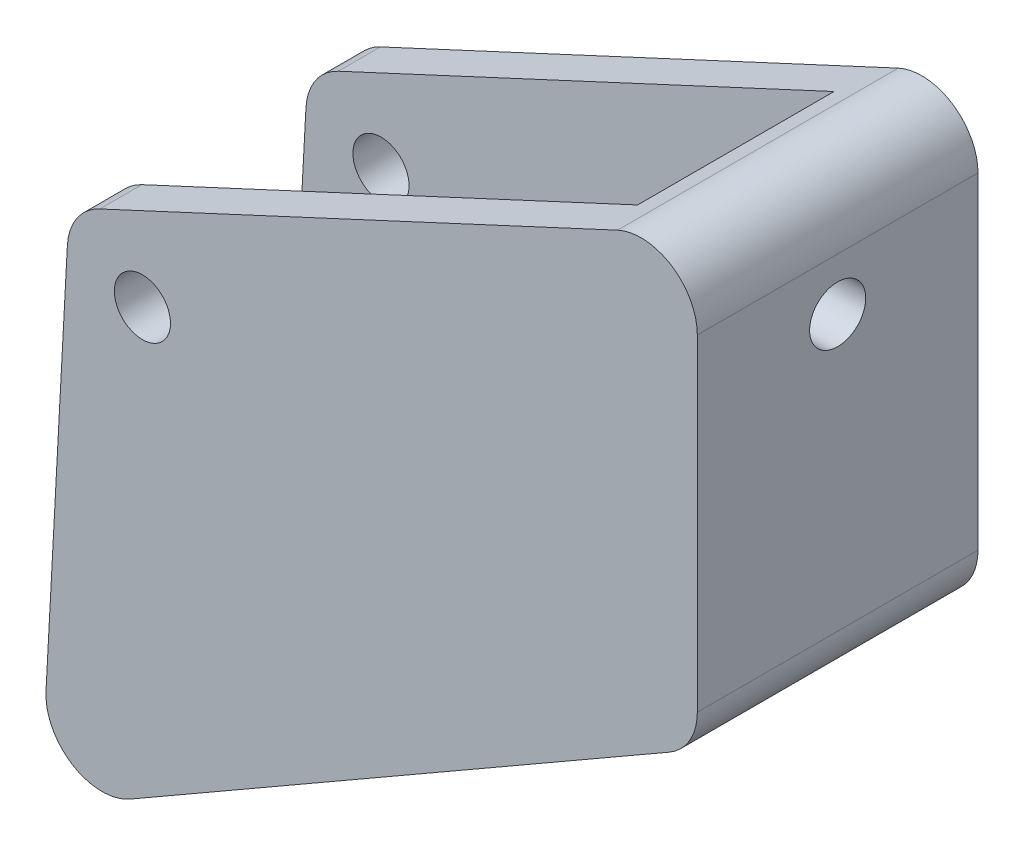
ISO-10303-21;
HEADER;
FILE_DESCRIPTION(('STEP AP214'),'2;1');
FILE_NAME('part.step','',(''),(''),'','','');
FILE_SCHEMA(('AUTOMOTIVE_DESIGN { 1 0 10303 214 1 1 1 1 }'));
ENDSEC;
DATA;
#1=APPLICATION_CONTEXT('core data for automotive mechanical design processes');
#2=APPLICATION_PROTOCOL_DEFINITION('international standard','automotive_design',2000,#1);
#3=PRODUCT_CONTEXT('',#1,'mechanical');
#4=PRODUCT('Part','Part','',(#3));
#5=PRODUCT_RELATED_PRODUCT_CATEGORY('part','',(#4));
#6=PRODUCT_DEFINITION_FORMATION('','',#4);
#7=PRODUCT_DEFINITION_CONTEXT('part definition',#1,'design');
#8=PRODUCT_DEFINITION('design','',#6,#7);
#9=PRODUCT_DEFINITION_SHAPE('','',#8);
#10=(LENGTH_UNIT() NAMED_UNIT(*) SI_UNIT(.MILLI.,.METRE.));
#11=(NAMED_UNIT(*) PLANE_ANGLE_UNIT() SI_UNIT($,.RADIAN.));
#12=(NAMED_UNIT(*) SI_UNIT($,.STERADIAN.) SOLID_ANGLE_UNIT());
#13=UNCERTAINTY_MEASURE_WITH_UNIT(LENGTH_MEASURE(1.E-05),#10,'distance_accuracy_value','');
#14=(GEOMETRIC_REPRESENTATION_CONTEXT(3) GLOBAL_UNCERTAINTY_ASSIGNED_CONTEXT((#13)) GLOBAL_UNIT_ASSIGNED_CONTEXT((#10,
#11,#12)) REPRESENTATION_CONTEXT('',''));
#15=CARTESIAN_POINT('',(0.,0.,0.));
#16=DIRECTION('',(0.,0.,1.));
#17=DIRECTION('',(1.,0.,0.));
#18=AXIS2_PLACEMENT_3D('',#15,#16,#17);
#19=CARTESIAN_POINT('',(-5.68733064188446,12.2435399362228,25.));
#20=DIRECTION('',(-0.421283751250701,0.90692888416465,0.));
#21=DIRECTION('',(-0.90692888416465,-0.421283751250701,0.));
#22=AXIS2_PLACEMENT_3D('',#19,#20,#21);
#23=PLANE('',#22);
#24=DIRECTION('',(0.90692888416465,0.421283751250701,0.));
#25=VECTOR('',#24,1.);
#26=CARTESIAN_POINT('',(-5.68733064188446,12.2435399362228,25.));
#27=LINE('',#26,#25);
#28=CARTESIAN_POINT('',(-7.59461311952046,11.3575750817532,25.));
#29=VERTEX_POINT('',#28);
#30=CARTESIAN_POINT('',(84.6368606244456,54.2006490213681,25.));
#31=VERTEX_POINT('',#30);
#32=EDGE_CURVE('E177',#29,#31,#27,.T.);
#33=ORIENTED_EDGE('',*,*,#32,.T.);
#34=DIRECTION('',(0.,0.,-1.));
#35=VECTOR('',#34,1.);
#36=CARTESIAN_POINT('',(84.6368606244456,54.2006490213681,-25.));
#37=LINE('',#36,#35);
#38=CARTESIAN_POINT('',(84.6368606244456,54.2006490213681,-25.));
#39=VERTEX_POINT('',#38);
#40=EDGE_CURVE('E220',#31,#39,#37,.T.);
#41=ORIENTED_EDGE('',*,*,#40,.T.);
#42=DIRECTION('',(0.90692888416465,0.421283751250701,0.));
#43=VECTOR('',#42,1.);
#44=CARTESIAN_POINT('',(-5.68733064188446,12.2435399362228,-25.));
#45=LINE('',#44,#43);
#46=CARTESIAN_POINT('',(-7.59461311952046,11.3575750817532,-25.));
#47=VERTEX_POINT('',#46);
#48=EDGE_CURVE('E188',#47,#39,#45,.T.);
#49=ORIENTED_EDGE('',*,*,#48,.F.);
#50=DIRECTION('',(0.,0.,-1.));
#51=VECTOR('',#50,1.);
#52=CARTESIAN_POINT('',(-7.59461311952046,11.3575750817532,-17.5));
#53=LINE('',#52,#51);
#54=CARTESIAN_POINT('',(-7.59461311952047,11.3575750817532,-17.5));
#55=VERTEX_POINT('',#54);
#56=EDGE_CURVE('E204',#47,#55,#53,.F.);
#57=ORIENTED_EDGE('',*,*,#56,.T.);
#58=DIRECTION('',(-0.90692888416465,-0.421283751250701,0.));
#59=VECTOR('',#58,1.);
#60=CARTESIAN_POINT('',(-13.0439916270519,8.82624692612571,-17.5));
#61=LINE('',#60,#59);
#62=CARTESIAN_POINT('',(80.7111204536596,52.3770765511765,-17.5));
#63=VERTEX_POINT('',#62);
#64=EDGE_CURVE('E165',#63,#55,#61,.T.);
#65=ORIENTED_EDGE('',*,*,#64,.F.);
#66=DIRECTION('',(0.,0.,1.));
#67=VECTOR('',#66,1.);
#68=CARTESIAN_POINT('',(80.7111204536596,52.3770765511765,-17.5));
#69=LINE('',#68,#67);
#70=CARTESIAN_POINT('',(80.7111204536596,52.3770765511765,17.5));
#71=VERTEX_POINT('',#70);
#72=EDGE_CURVE('E167',#63,#71,#69,.T.);
#73=ORIENTED_EDGE('',*,*,#72,.T.);
#74=DIRECTION('',(-0.90692888416465,-0.421283751250701,0.));
#75=VECTOR('',#74,1.);
#76=CARTESIAN_POINT('',(-13.0439916270519,8.82624692612571,17.5));
#77=LINE('',#76,#75);
#78=CARTESIAN_POINT('',(-7.59461311952047,11.3575750817532,17.5));
#79=VERTEX_POINT('',#78);
#80=EDGE_CURVE('E148',#71,#79,#77,.T.);
#81=ORIENTED_EDGE('',*,*,#80,.T.);
#82=DIRECTION('',(0.,0.,-1.));
#83=VECTOR('',#82,1.);
#84=CARTESIAN_POINT('',(-7.59461311952046,11.3575750817532,25.));
#85=LINE('',#84,#83);
#86=EDGE_CURVE('E202',#79,#29,#85,.F.);
#87=ORIENTED_EDGE('',*,*,#86,.T.);
#88=EDGE_LOOP('',(#33,#41,#49,#57,#65,#73,#81,#87));
#89=FACE_BOUND('',#88,.T.);
#90=ADVANCED_FACE('F39',(#89),#23,.T.);
#91=CARTESIAN_POINT('',(-13.4804441192856,0.726378927845342,25.));
#92=DIRECTION('',(0.998551416243379,-0.0538058465070624,0.));
#93=DIRECTION('',(0.0538058465070624,0.998551416243379,0.));
#94=AXIS2_PLACEMENT_3D('',#91,#92,#93);
#95=PLANE('',#94);
#96=DIRECTION('',(-0.0538058465070624,-0.998551416243379,0.));
#97=VECTOR('',#96,1.);
#98=CARTESIAN_POINT('',(-13.4804441192856,0.726378927845342,-25.));
#99=LINE('',#98,#97);
#100=CARTESIAN_POINT('',(-13.3672897694472,2.82634470517728,-25.));
#101=VERTEX_POINT('',#100);
#102=CARTESIAN_POINT('',(-17.1719818870437,-67.7827238074289,-25.));
#103=VERTEX_POINT('',#102);
#104=EDGE_CURVE('E175',#101,#103,#99,.T.);
#105=ORIENTED_EDGE('',*,*,#104,.T.);
#106=DIRECTION('',(0.,0.,-1.));
#107=VECTOR('',#106,1.);
#108=CARTESIAN_POINT('',(-17.1719818870437,-67.7827238074289,25.));
#109=LINE('',#108,#107);
#110=CARTESIAN_POINT('',(-17.1719818870437,-67.7827238074289,25.));
#111=VERTEX_POINT('',#110);
#112=EDGE_CURVE('E216',#103,#111,#109,.F.);
#113=ORIENTED_EDGE('',*,*,#112,.T.);
#114=DIRECTION('',(-0.0538058465070624,-0.998551416243379,0.));
#115=VECTOR('',#114,1.);
#116=CARTESIAN_POINT('',(-13.4804441192856,0.726378927845342,25.));
#117=LINE('',#116,#115);
#118=CARTESIAN_POINT('',(-13.3672897694472,2.82634470517728,25.));
#119=VERTEX_POINT('',#118);
#120=EDGE_CURVE('E180',#119,#111,#117,.T.);
#121=ORIENTED_EDGE('',*,*,#120,.F.);
#122=DIRECTION('',(0.,0.,-1.));
#123=VECTOR('',#122,1.);
#124=CARTESIAN_POINT('',(-13.3672897694472,2.82634470517728,17.5));
#125=LINE('',#124,#123);
#126=CARTESIAN_POINT('',(-13.3672897694472,2.82634470517728,17.5));
#127=VERTEX_POINT('',#126);
#128=EDGE_CURVE('E183',#119,#127,#125,.T.);
#129=ORIENTED_EDGE('',*,*,#128,.T.);
#130=DIRECTION('',(-0.0538058465070623,-0.998551416243379,0.));
#131=VECTOR('',#130,1.);
#132=CARTESIAN_POINT('',(-13.0439916270519,8.82624692612571,17.5));
#133=LINE('',#132,#131);
#134=CARTESIAN_POINT('',(-16.8158647566939,-61.1737530738743,17.5));
#135=VERTEX_POINT('',#134);
#136=EDGE_CURVE('E163',#127,#135,#133,.T.);
#137=ORIENTED_EDGE('',*,*,#136,.T.);
#138=DIRECTION('',(0.,0.,1.));
#139=VECTOR('',#138,1.);
#140=CARTESIAN_POINT('',(-16.8158647566939,-61.1737530738743,-17.5));
#141=LINE('',#140,#139);
#142=CARTESIAN_POINT('',(-16.8158647566939,-61.1737530738743,-17.5));
#143=VERTEX_POINT('',#142);
#144=EDGE_CURVE('E154',#143,#135,#141,.T.);
#145=ORIENTED_EDGE('',*,*,#144,.F.);
#146=DIRECTION('',(-0.0538058465070623,-0.998551416243379,0.));
#147=VECTOR('',#146,1.);
#148=CARTESIAN_POINT('',(-13.0439916270519,8.82624692612571,-17.5));
#149=LINE('',#148,#147);
#150=CARTESIAN_POINT('',(-13.3672897694472,2.82634470517728,-17.5));
#151=VERTEX_POINT('',#150);
#152=EDGE_CURVE('E136',#151,#143,#149,.T.);
#153=ORIENTED_EDGE('',*,*,#152,.F.);
#154=DIRECTION('',(0.,0.,-1.));
#155=VECTOR('',#154,1.);
#156=CARTESIAN_POINT('',(-13.3672897694472,2.82634470517728,-25.));
#157=LINE('',#156,#155);
#158=EDGE_CURVE('E198',#151,#101,#157,.T.);
#159=ORIENTED_EDGE('',*,*,#158,.T.);
#160=EDGE_LOOP('',(#105,#113,#121,#129,#137,#145,#153,#159));
#161=FACE_BOUND('',#160,.T.);
#162=ADVANCED_FACE('F160',(#161),#95,.F.);
#163=CARTESIAN_POINT('',(32.7331387934227,-56.8886803493438,25.));
#164=DIRECTION('',(-0.498724699906825,0.866760447703313,0.));
#165=DIRECTION('',(-0.866760447703313,-0.498724699906825,0.));
#166=AXIS2_PLACEMENT_3D('',#163,#164,#165);
#167=PLANE('',#166);
#168=DIRECTION('',(0.866760447703313,0.498724699906825,0.));
#169=VECTOR('',#168,1.);
#170=CARTESIAN_POINT('',(32.7331387934227,-56.8886803493438,-25.));
#171=LINE('',#170,#169);
#172=CARTESIAN_POINT('',(-2.19922072554161,-76.9883867495326,-25.));
#173=VERTEX_POINT('',#172);
#174=CARTESIAN_POINT('',(93.8369451360209,-21.730203099805,-25.));
#175=VERTEX_POINT('',#174);
#176=EDGE_CURVE('E184',#173,#175,#171,.T.);
#177=ORIENTED_EDGE('',*,*,#176,.T.);
#178=DIRECTION('',(0.,0.,-1.));
#179=VECTOR('',#178,1.);
#180=CARTESIAN_POINT('',(93.8369451360209,-21.730203099805,25.));
#181=LINE('',#180,#179);
#182=CARTESIAN_POINT('',(93.8369451360209,-21.730203099805,25.));
#183=VERTEX_POINT('',#182);
#184=EDGE_CURVE('E11',#175,#183,#181,.F.);
#185=ORIENTED_EDGE('',*,*,#184,.T.);
#186=DIRECTION('',(0.866760447703313,0.498724699906825,0.));
#187=VECTOR('',#186,1.);
#188=CARTESIAN_POINT('',(32.7331387934227,-56.8886803493438,25.));
#189=LINE('',#188,#187);
#190=CARTESIAN_POINT('',(-2.19922072554161,-76.9883867495326,25.));
#191=VERTEX_POINT('',#190);
#192=EDGE_CURVE('E172',#191,#183,#189,.T.);
#193=ORIENTED_EDGE('',*,*,#192,.F.);
#194=DIRECTION('',(0.,0.,-1.));
#195=VECTOR('',#194,1.);
#196=CARTESIAN_POINT('',(-2.19922072554162,-76.9883867495326,25.));
#197=LINE('',#196,#195);
#198=EDGE_CURVE('E211',#191,#173,#197,.T.);
#199=ORIENTED_EDGE('',*,*,#198,.T.);
#200=EDGE_LOOP('',(#177,#185,#193,#199));
#201=FACE_BOUND('',#200,.T.);
#202=ADVANCED_FACE('F252',(#201),#167,.F.);
#203=CARTESIAN_POINT('',(98.8496981369526,0.,25.));
#204=DIRECTION('',(-1.,0.,0.));
#205=DIRECTION('',(0.,0.,1.));
#206=AXIS2_PLACEMENT_3D('',#203,#204,#205);
#207=PLANE('',#206);
#208=CARTESIAN_POINT('',(98.8496981369526,35.8374470812737,0.));
#209=DIRECTION('',(-1.,0.,0.));
#210=DIRECTION('',(0.,-1.,0.));
#211=AXIS2_PLACEMENT_3D('',#208,#209,#210);
#212=ELLIPSE('',#211,5.0027643104733,5.);
#213=CARTESIAN_POINT('',(98.8496981369526,30.8346827708004,0.));
#214=VERTEX_POINT('',#213);
#215=EDGE_CURVE('E432',#214,#214,#212,.T.);
#216=ORIENTED_EDGE('',*,*,#215,.T.);
#217=EDGE_LOOP('',(#216));
#218=FACE_BOUND('',#217,.T.);
#219=DIRECTION('',(0.,1.,0.));
#220=VECTOR('',#219,1.);
#221=CARTESIAN_POINT('',(98.8496981369526,0.,-25.));
#222=LINE('',#221,#220);
#223=CARTESIAN_POINT('',(98.8496981369526,-13.0625986227718,-25.));
#224=VERTEX_POINT('',#223);
#225=CARTESIAN_POINT('',(98.8496981369526,45.1313601797216,-25.));
#226=VERTEX_POINT('',#225);
#227=EDGE_CURVE('E186',#224,#226,#222,.T.);
#228=ORIENTED_EDGE('',*,*,#227,.T.);
#229=DIRECTION('',(0.,0.,-1.));
#230=VECTOR('',#229,1.);
#231=CARTESIAN_POINT('',(98.8496981369526,45.1313601797216,25.));
#232=LINE('',#231,#230);
#233=CARTESIAN_POINT('',(98.8496981369526,45.1313601797216,25.));
#234=VERTEX_POINT('',#233);
#235=EDGE_CURVE('E60',#226,#234,#232,.F.);
#236=ORIENTED_EDGE('',*,*,#235,.T.);
#237=DIRECTION('',(0.,1.,0.));
#238=VECTOR('',#237,1.);
#239=CARTESIAN_POINT('',(98.8496981369526,0.,25.));
#240=LINE('',#239,#238);
#241=CARTESIAN_POINT('',(98.8496981369526,-13.0625986227718,25.));
#242=VERTEX_POINT('',#241);
#243=EDGE_CURVE('E174',#242,#234,#240,.T.);
#244=ORIENTED_EDGE('',*,*,#243,.F.);
#245=DIRECTION('',(0.,0.,-1.));
#246=VECTOR('',#245,1.);
#247=CARTESIAN_POINT('',(98.8496981369526,-13.0625986227718,25.));
#248=LINE('',#247,#246);
#249=EDGE_CURVE('E227',#242,#224,#248,.T.);
#250=ORIENTED_EDGE('',*,*,#249,.T.);
#251=EDGE_LOOP('',(#228,#236,#244,#250));
#252=FACE_BOUND('',#251,.T.);
#253=ADVANCED_FACE('F247',(#218,#252),#207,.F.);
#254=CARTESIAN_POINT('',(0.,0.,25.));
#255=DIRECTION('',(0.,0.,1.));
#256=DIRECTION('',(1.,0.,0.));
#257=AXIS2_PLACEMENT_3D('',#254,#255,#256);
#258=PLANE('',#257);
#259=CARTESIAN_POINT('',(0.,0.,25.));
#260=DIRECTION('',(0.,0.,1.));
#261=DIRECTION('',(1.,0.,0.));
#262=AXIS2_PLACEMENT_3D('',#259,#260,#261);
#263=CIRCLE('',#262,4.99999999999999);
#264=CARTESIAN_POINT('',(5.,0.,25.));
#265=VERTEX_POINT('',#264);
#266=EDGE_CURVE('E433',#265,#265,#263,.T.);
#267=ORIENTED_EDGE('',*,*,#266,.F.);
#268=EDGE_LOOP('',(#267));
#269=FACE_BOUND('',#268,.T.);
#270=ORIENTED_EDGE('',*,*,#243,.T.);
#271=CARTESIAN_POINT('',(88.8496981369527,45.1313601797216,25.));
#272=DIRECTION('',(0.,0.,1.));
#273=DIRECTION('',(1.,0.,0.));
#274=AXIS2_PLACEMENT_3D('',#271,#272,#273);
#275=CIRCLE('',#274,10.);
#276=EDGE_CURVE('E47',#234,#31,#275,.T.);
#277=ORIENTED_EDGE('',*,*,#276,.T.);
#278=ORIENTED_EDGE('',*,*,#32,.F.);
#279=CARTESIAN_POINT('',(-3.38177560701345,2.28828624010666,25.));
#280=DIRECTION('',(0.,0.,1.));
#281=DIRECTION('',(1.,0.,0.));
#282=AXIS2_PLACEMENT_3D('',#279,#280,#281);
#283=CIRCLE('',#282,10.);
#284=EDGE_CURVE('E209',#29,#119,#283,.T.);
#285=ORIENTED_EDGE('',*,*,#284,.T.);
#286=ORIENTED_EDGE('',*,*,#120,.T.);
#287=CARTESIAN_POINT('',(-7.18646772460988,-68.3207822724995,25.));
#288=DIRECTION('',(0.,0.,1.));
#289=DIRECTION('',(1.,0.,0.));
#290=AXIS2_PLACEMENT_3D('',#287,#288,#289);
#291=CIRCLE('',#290,10.);
#292=EDGE_CURVE('E218',#111,#191,#291,.T.);
#293=ORIENTED_EDGE('',*,*,#292,.T.);
#294=ORIENTED_EDGE('',*,*,#192,.T.);
#295=CARTESIAN_POINT('',(88.8496981369527,-13.0625986227718,25.));
#296=DIRECTION('',(0.,0.,1.));
#297=DIRECTION('',(1.,0.,0.));
#298=AXIS2_PLACEMENT_3D('',#295,#296,#297);
#299=CIRCLE('',#298,10.);
#300=EDGE_CURVE('E231',#183,#242,#299,.T.);
#301=ORIENTED_EDGE('',*,*,#300,.T.);
#302=EDGE_LOOP('',(#270,#277,#278,#285,#286,#293,#294,#301));
#303=FACE_BOUND('',#302,.T.);
#304=ADVANCED_FACE('F235',(#269,#303),#258,.T.);
#305=CARTESIAN_POINT('',(0.,0.,-25.));
#306=DIRECTION('',(0.,0.,1.));
#307=DIRECTION('',(1.,0.,0.));
#308=AXIS2_PLACEMENT_3D('',#305,#306,#307);
#309=PLANE('',#308);
#310=CARTESIAN_POINT('',(0.,0.,-25.));
#311=DIRECTION('',(0.,0.,1.));
#312=DIRECTION('',(1.,0.,0.));
#313=AXIS2_PLACEMENT_3D('',#310,#311,#312);
#314=CIRCLE('',#313,4.99999999999999);
#315=CARTESIAN_POINT('',(5.,0.,-25.));
#316=VERTEX_POINT('',#315);
#317=EDGE_CURVE('E196',#316,#316,#314,.T.);
#318=ORIENTED_EDGE('',*,*,#317,.T.);
#319=EDGE_LOOP('',(#318));
#320=FACE_BOUND('',#319,.T.);
#321=ORIENTED_EDGE('',*,*,#48,.T.);
#322=CARTESIAN_POINT('',(88.8496981369527,45.1313601797216,-25.));
#323=DIRECTION('',(0.,0.,1.));
#324=DIRECTION('',(1.,0.,0.));
#325=AXIS2_PLACEMENT_3D('',#322,#323,#324);
#326=CIRCLE('',#325,10.);
#327=EDGE_CURVE('E225',#39,#226,#326,.F.);
#328=ORIENTED_EDGE('',*,*,#327,.T.);
#329=ORIENTED_EDGE('',*,*,#227,.F.);
#330=CARTESIAN_POINT('',(88.8496981369527,-13.0625986227718,-25.));
#331=DIRECTION('',(0.,0.,1.));
#332=DIRECTION('',(1.,0.,0.));
#333=AXIS2_PLACEMENT_3D('',#330,#331,#332);
#334=CIRCLE('',#333,10.);
#335=EDGE_CURVE('E223',#224,#175,#334,.F.);
#336=ORIENTED_EDGE('',*,*,#335,.T.);
#337=ORIENTED_EDGE('',*,*,#176,.F.);
#338=CARTESIAN_POINT('',(-7.18646772460988,-68.3207822724995,-25.));
#339=DIRECTION('',(0.,0.,1.));
#340=DIRECTION('',(1.,0.,0.));
#341=AXIS2_PLACEMENT_3D('',#338,#339,#340);
#342=CIRCLE('',#341,10.);
#343=EDGE_CURVE('E214',#173,#103,#342,.F.);
#344=ORIENTED_EDGE('',*,*,#343,.T.);
#345=ORIENTED_EDGE('',*,*,#104,.F.);
#346=CARTESIAN_POINT('',(-3.38177560701345,2.28828624010666,-25.));
#347=DIRECTION('',(0.,0.,1.));
#348=DIRECTION('',(1.,0.,0.));
#349=AXIS2_PLACEMENT_3D('',#346,#347,#348);
#350=CIRCLE('',#349,10.);
#351=EDGE_CURVE('E200',#101,#47,#350,.F.);
#352=ORIENTED_EDGE('',*,*,#351,.T.);
#353=EDGE_LOOP('',(#321,#328,#329,#336,#337,#344,#345,#352));
#354=FACE_BOUND('',#353,.T.);
#355=ADVANCED_FACE('F246',(#320,#354),#309,.F.);
#356=CARTESIAN_POINT('',(82.9463125014176,-14.8325404362972,-17.5));
#357=DIRECTION('',(0.999447443392944,0.0332386506240665,0.));
#358=DIRECTION('',(-0.0332386506240665,0.999447443392944,0.));
#359=AXIS2_PLACEMENT_3D('',#356,#357,#358);
#360=PLANE('',#359);
#361=CARTESIAN_POINT('',(81.280611292157,35.2531514854637,0.));
#362=DIRECTION('',(-0.999447443392944,-0.0332386506240665,0.));
#363=DIRECTION('',(0.0332386506240665,-0.999447443392944,0.));
#364=AXIS2_PLACEMENT_3D('',#361,#362,#363);
#365=CIRCLE('',#364,5.);
#366=CARTESIAN_POINT('',(81.4468045452774,30.255914268499,0.));
#367=VERTEX_POINT('',#366);
#368=EDGE_CURVE('E429',#367,#367,#365,.T.);
#369=ORIENTED_EDGE('',*,*,#368,.F.);
#370=EDGE_LOOP('',(#369));
#371=FACE_BOUND('',#370,.T.);
#372=DIRECTION('',(-0.0332386506240665,0.999447443392944,0.));
#373=VECTOR('',#372,1.);
#374=CARTESIAN_POINT('',(82.9463125014176,-14.8325404362972,17.5));
#375=LINE('',#374,#373);
#376=CARTESIAN_POINT('',(82.9463125014176,-14.8325404362972,17.5));
#377=VERTEX_POINT('',#376);
#378=EDGE_CURVE('E271',#377,#71,#375,.T.);
#379=ORIENTED_EDGE('',*,*,#378,.T.);
#380=ORIENTED_EDGE('',*,*,#72,.F.);
#381=DIRECTION('',(-0.0332386506240665,0.999447443392944,0.));
#382=VECTOR('',#381,1.);
#383=CARTESIAN_POINT('',(82.9463125014176,-14.8325404362972,-17.5));
#384=LINE('',#383,#382);
#385=CARTESIAN_POINT('',(82.9463125014176,-14.8325404362972,-17.5));
#386=VERTEX_POINT('',#385);
#387=EDGE_CURVE('E157',#386,#63,#384,.T.);
#388=ORIENTED_EDGE('',*,*,#387,.F.);
#389=DIRECTION('',(0.,0.,1.));
#390=VECTOR('',#389,1.);
#391=CARTESIAN_POINT('',(82.9463125014176,-14.8325404362972,-17.5));
#392=LINE('',#391,#390);
#393=EDGE_CURVE('E155',#386,#377,#392,.T.);
#394=ORIENTED_EDGE('',*,*,#393,.T.);
#395=EDGE_LOOP('',(#379,#380,#388,#394));
#396=FACE_BOUND('',#395,.T.);
#397=ADVANCED_FACE('F274',(#371,#396),#360,.F.);
#398=CARTESIAN_POINT('',(-16.8158647566939,-61.1737530738743,-17.5));
#399=DIRECTION('',(0.421283751250701,-0.90692888416465,0.));
#400=DIRECTION('',(0.90692888416465,0.421283751250701,0.));
#401=AXIS2_PLACEMENT_3D('',#398,#399,#400);
#402=PLANE('',#401);
#403=DIRECTION('',(0.90692888416465,0.421283751250701,0.));
#404=VECTOR('',#403,1.);
#405=CARTESIAN_POINT('',(-16.8158647566939,-61.1737530738743,17.5));
#406=LINE('',#405,#404);
#407=EDGE_CURVE('E269',#135,#377,#406,.T.);
#408=ORIENTED_EDGE('',*,*,#407,.T.);
#409=ORIENTED_EDGE('',*,*,#393,.F.);
#410=DIRECTION('',(0.90692888416465,0.421283751250701,0.));
#411=VECTOR('',#410,1.);
#412=CARTESIAN_POINT('',(-16.8158647566939,-61.1737530738743,-17.5));
#413=LINE('',#412,#411);
#414=EDGE_CURVE('E141',#143,#386,#413,.T.);
#415=ORIENTED_EDGE('',*,*,#414,.F.);
#416=ORIENTED_EDGE('',*,*,#144,.T.);
#417=EDGE_LOOP('',(#408,#409,#415,#416));
#418=FACE_BOUND('',#417,.T.);
#419=ADVANCED_FACE('F153',(#418),#402,.F.);
#420=CARTESIAN_POINT('',(0.,0.,-17.5));
#421=DIRECTION('',(0.,0.,1.));
#422=DIRECTION('',(1.,0.,0.));
#423=AXIS2_PLACEMENT_3D('',#420,#421,#422);
#424=PLANE('',#423);
#425=CARTESIAN_POINT('',(0.,0.,-17.5));
#426=DIRECTION('',(0.,0.,1.));
#427=DIRECTION('',(1.,0.,0.));
#428=AXIS2_PLACEMENT_3D('',#425,#426,#427);
#429=CIRCLE('',#428,4.99999999999999);
#430=CARTESIAN_POINT('',(5.,0.,-17.5));
#431=VERTEX_POINT('',#430);
#432=EDGE_CURVE('E195',#431,#431,#429,.T.);
#433=ORIENTED_EDGE('',*,*,#432,.F.);
#434=EDGE_LOOP('',(#433));
#435=FACE_BOUND('',#434,.T.);
#436=ORIENTED_EDGE('',*,*,#64,.T.);
#437=CARTESIAN_POINT('',(-3.38177560701345,2.28828624010666,-17.5));
#438=DIRECTION('',(0.,0.,1.));
#439=DIRECTION('',(1.,0.,0.));
#440=AXIS2_PLACEMENT_3D('',#437,#438,#439);
#441=CIRCLE('',#440,10.);
#442=EDGE_CURVE('E143',#55,#151,#441,.T.);
#443=ORIENTED_EDGE('',*,*,#442,.T.);
#444=ORIENTED_EDGE('',*,*,#152,.T.);
#445=ORIENTED_EDGE('',*,*,#414,.T.);
#446=ORIENTED_EDGE('',*,*,#387,.T.);
#447=EDGE_LOOP('',(#436,#443,#444,#445,#446));
#448=FACE_BOUND('',#447,.T.);
#449=ADVANCED_FACE('F139',(#435,#448),#424,.T.);
#450=CARTESIAN_POINT('',(0.,0.,17.5));
#451=DIRECTION('',(0.,0.,1.));
#452=DIRECTION('',(1.,0.,0.));
#453=AXIS2_PLACEMENT_3D('',#450,#451,#452);
#454=PLANE('',#453);
#455=CARTESIAN_POINT('',(0.,0.,17.5));
#456=DIRECTION('',(0.,0.,1.));
#457=DIRECTION('',(1.,0.,0.));
#458=AXIS2_PLACEMENT_3D('',#455,#456,#457);
#459=CIRCLE('',#458,4.99999999999999);
#460=CARTESIAN_POINT('',(5.,0.,17.5));
#461=VERTEX_POINT('',#460);
#462=EDGE_CURVE('E192',#461,#461,#459,.T.);
#463=ORIENTED_EDGE('',*,*,#462,.T.);
#464=EDGE_LOOP('',(#463));
#465=FACE_BOUND('',#464,.T.);
#466=ORIENTED_EDGE('',*,*,#136,.F.);
#467=CARTESIAN_POINT('',(-3.38177560701345,2.28828624010666,17.5));
#468=DIRECTION('',(0.,0.,1.));
#469=DIRECTION('',(1.,0.,0.));
#470=AXIS2_PLACEMENT_3D('',#467,#468,#469);
#471=CIRCLE('',#470,10.);
#472=EDGE_CURVE('E207',#127,#79,#471,.F.);
#473=ORIENTED_EDGE('',*,*,#472,.T.);
#474=ORIENTED_EDGE('',*,*,#80,.F.);
#475=ORIENTED_EDGE('',*,*,#378,.F.);
#476=ORIENTED_EDGE('',*,*,#407,.F.);
#477=EDGE_LOOP('',(#466,#473,#474,#475,#476));
#478=FACE_BOUND('',#477,.T.);
#479=ADVANCED_FACE('F277',(#465,#478),#454,.F.);
#480=CARTESIAN_POINT('',(0.,0.,-25.));
#481=DIRECTION('',(0.,0.,1.));
#482=DIRECTION('',(1.,0.,0.));
#483=AXIS2_PLACEMENT_3D('',#480,#481,#482);
#484=CYLINDRICAL_SURFACE('',#483,4.99999999999999);
#485=ORIENTED_EDGE('',*,*,#266,.T.);
#486=EDGE_LOOP('',(#485));
#487=FACE_BOUND('',#486,.T.);
#488=ORIENTED_EDGE('',*,*,#462,.F.);
#489=EDGE_LOOP('',(#488));
#490=FACE_BOUND('',#489,.T.);
#491=ADVANCED_FACE('F354',(#487,#490),#484,.F.);
#492=ORIENTED_EDGE('',*,*,#432,.T.);
#493=EDGE_LOOP('',(#492));
#494=FACE_BOUND('',#493,.T.);
#495=ORIENTED_EDGE('',*,*,#317,.F.);
#496=EDGE_LOOP('',(#495));
#497=FACE_BOUND('',#496,.T.);
#498=ADVANCED_FACE('F288',(#494,#497),#484,.F.);
#499=CARTESIAN_POINT('',(-3.38177560701345,2.28828624010666,25.));
#500=DIRECTION('',(0.,0.,1.));
#501=DIRECTION('',(1.,0.,0.));
#502=AXIS2_PLACEMENT_3D('',#499,#500,#501);
#503=CYLINDRICAL_SURFACE('',#502,10.);
#504=ORIENTED_EDGE('',*,*,#442,.F.);
#505=ORIENTED_EDGE('',*,*,#56,.F.);
#506=ORIENTED_EDGE('',*,*,#351,.F.);
#507=ORIENTED_EDGE('',*,*,#158,.F.);
#508=EDGE_LOOP('',(#504,#505,#506,#507));
#509=FACE_BOUND('',#508,.T.);
#510=ADVANCED_FACE('F261',(#509),#503,.T.);
#511=CARTESIAN_POINT('',(-3.38177560701345,2.28828624010666,25.));
#512=DIRECTION('',(0.,0.,1.));
#513=DIRECTION('',(1.,0.,0.));
#514=AXIS2_PLACEMENT_3D('',#511,#512,#513);
#515=CYLINDRICAL_SURFACE('',#514,10.);
#516=ORIENTED_EDGE('',*,*,#284,.F.);
#517=ORIENTED_EDGE('',*,*,#86,.F.);
#518=ORIENTED_EDGE('',*,*,#472,.F.);
#519=ORIENTED_EDGE('',*,*,#128,.F.);
#520=EDGE_LOOP('',(#516,#517,#518,#519));
#521=FACE_BOUND('',#520,.T.);
#522=ADVANCED_FACE('F280',(#521),#515,.T.);
#523=CARTESIAN_POINT('',(-7.18646772460988,-68.3207822724995,25.));
#524=DIRECTION('',(0.,0.,-1.));
#525=DIRECTION('',(-1.,0.,0.));
#526=AXIS2_PLACEMENT_3D('',#523,#524,#525);
#527=CYLINDRICAL_SURFACE('',#526,10.);
#528=ORIENTED_EDGE('',*,*,#292,.F.);
#529=ORIENTED_EDGE('',*,*,#112,.F.);
#530=ORIENTED_EDGE('',*,*,#343,.F.);
#531=ORIENTED_EDGE('',*,*,#198,.F.);
#532=EDGE_LOOP('',(#528,#529,#530,#531));
#533=FACE_BOUND('',#532,.T.);
#534=ADVANCED_FACE('F256',(#533),#527,.T.);
#535=CARTESIAN_POINT('',(88.8496981369527,45.1313601797216,25.));
#536=DIRECTION('',(0.,0.,1.));
#537=DIRECTION('',(1.,0.,0.));
#538=AXIS2_PLACEMENT_3D('',#535,#536,#537);
#539=CYLINDRICAL_SURFACE('',#538,10.);
#540=ORIENTED_EDGE('',*,*,#276,.F.);
#541=ORIENTED_EDGE('',*,*,#235,.F.);
#542=ORIENTED_EDGE('',*,*,#327,.F.);
#543=ORIENTED_EDGE('',*,*,#40,.F.);
#544=EDGE_LOOP('',(#540,#541,#542,#543));
#545=FACE_BOUND('',#544,.T.);
#546=ADVANCED_FACE('F243',(#545),#539,.T.);
#547=CARTESIAN_POINT('',(88.8496981369527,-13.0625986227718,25.));
#548=DIRECTION('',(0.,0.,-1.));
#549=DIRECTION('',(-1.,0.,0.));
#550=AXIS2_PLACEMENT_3D('',#547,#548,#549);
#551=CYLINDRICAL_SURFACE('',#550,10.);
#552=ORIENTED_EDGE('',*,*,#300,.F.);
#553=ORIENTED_EDGE('',*,*,#184,.F.);
#554=ORIENTED_EDGE('',*,*,#335,.F.);
#555=ORIENTED_EDGE('',*,*,#249,.F.);
#556=EDGE_LOOP('',(#552,#553,#554,#555));
#557=FACE_BOUND('',#556,.T.);
#558=ADVANCED_FACE('F41',(#557),#551,.T.);
#559=CARTESIAN_POINT('',(99.4906474170415,35.8587631487963,0.));
#560=DIRECTION('',(-0.999447443392943,-0.0332386506240665,0.));
#561=DIRECTION('',(0.0332386506240665,-0.999447443392944,0.));
#562=AXIS2_PLACEMENT_3D('',#559,#560,#561);
#563=CYLINDRICAL_SURFACE('',#562,5.);
#564=ORIENTED_EDGE('',*,*,#368,.T.);
#565=EDGE_LOOP('',(#564));
#566=FACE_BOUND('',#565,.T.);
#567=ORIENTED_EDGE('',*,*,#215,.F.);
#568=EDGE_LOOP('',(#567));
#569=FACE_BOUND('',#568,.T.);
#570=ADVANCED_FACE('F412',(#566,#569),#563,.F.);
#571=CLOSED_SHELL('',(#90,#162,#202,#253,#304,#355,#397,#419,#449,#479,#491,#498,#510,#522,#534,
#546,#558,#570));
#572=MANIFOLD_SOLID_BREP('B2',#571);
#573=ADVANCED_BREP_SHAPE_REPRESENTATION('',(#18,#572),#14);
#574=SHAPE_DEFINITION_REPRESENTATION(#9,#573);
ENDSEC;
END-ISO-10303-21;
